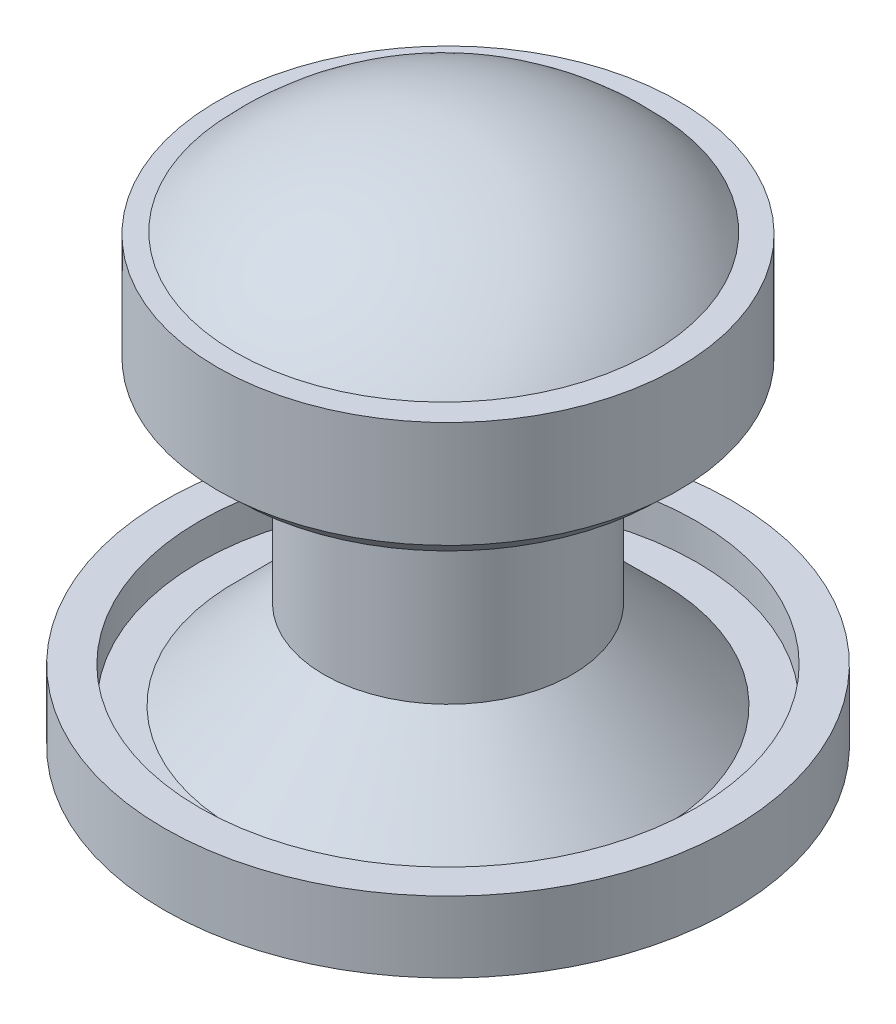
ISO-10303-21;
HEADER;
FILE_DESCRIPTION(('STEP AP214'),'2;1');
FILE_NAME('part.step','',(''),(''),'','','');
FILE_SCHEMA(('AUTOMOTIVE_DESIGN { 1 0 10303 214 1 1 1 1 }'));
ENDSEC;
DATA;
#1=APPLICATION_CONTEXT('core data for automotive mechanical design processes');
#2=APPLICATION_PROTOCOL_DEFINITION('international standard','automotive_design',2000,#1);
#3=PRODUCT_CONTEXT('',#1,'mechanical');
#4=PRODUCT('Part','Part','',(#3));
#5=PRODUCT_RELATED_PRODUCT_CATEGORY('part','',(#4));
#6=PRODUCT_DEFINITION_FORMATION('','',#4);
#7=PRODUCT_DEFINITION_CONTEXT('part definition',#1,'design');
#8=PRODUCT_DEFINITION('design','',#6,#7);
#9=PRODUCT_DEFINITION_SHAPE('','',#8);
#10=(LENGTH_UNIT() NAMED_UNIT(*) SI_UNIT(.MILLI.,.METRE.));
#11=(NAMED_UNIT(*) PLANE_ANGLE_UNIT() SI_UNIT($,.RADIAN.));
#12=(NAMED_UNIT(*) SI_UNIT($,.STERADIAN.) SOLID_ANGLE_UNIT());
#13=UNCERTAINTY_MEASURE_WITH_UNIT(LENGTH_MEASURE(1.E-05),#10,'distance_accuracy_value','');
#14=(GEOMETRIC_REPRESENTATION_CONTEXT(3) GLOBAL_UNCERTAINTY_ASSIGNED_CONTEXT((#13)) GLOBAL_UNIT_ASSIGNED_CONTEXT((#10,
#11,#12)) REPRESENTATION_CONTEXT('',''));
#15=CARTESIAN_POINT('',(0.,0.,0.));
#16=DIRECTION('',(0.,0.,1.));
#17=DIRECTION('',(1.,0.,0.));
#18=AXIS2_PLACEMENT_3D('',#15,#16,#17);
#19=CARTESIAN_POINT('',(0.,1.,0.));
#20=DIRECTION('',(0.,1.,0.));
#21=DIRECTION('',(0.,0.,1.));
#22=AXIS2_PLACEMENT_3D('',#19,#20,#21);
#23=PLANE('',#22);
#24=CARTESIAN_POINT('',(0.,1.,0.));
#25=DIRECTION('',(0.,1.,0.));
#26=DIRECTION('',(0.,0.,1.));
#27=AXIS2_PLACEMENT_3D('',#24,#25,#26);
#28=CIRCLE('',#27,6.);
#29=CARTESIAN_POINT('',(0.,1.,6.));
#30=VERTEX_POINT('',#29);
#31=EDGE_CURVE('E55',#30,#30,#28,.T.);
#32=ORIENTED_EDGE('',*,*,#31,.F.);
#33=EDGE_LOOP('',(#32));
#34=FACE_BOUND('',#33,.T.);
#35=CARTESIAN_POINT('',(0.,1.,0.));
#36=DIRECTION('',(0.,1.,0.));
#37=DIRECTION('',(0.,0.,1.));
#38=AXIS2_PLACEMENT_3D('',#35,#36,#37);
#39=CIRCLE('',#38,7.);
#40=CARTESIAN_POINT('',(0.,1.,7.));
#41=VERTEX_POINT('',#40);
#42=EDGE_CURVE('E46',#41,#41,#39,.F.);
#43=ORIENTED_EDGE('',*,*,#42,.F.);
#44=EDGE_LOOP('',(#43));
#45=FACE_BOUND('',#44,.T.);
#46=ADVANCED_FACE('F34',(#34,#45),#23,.T.);
#47=CARTESIAN_POINT('',(0.,1.,0.));
#48=DIRECTION('',(0.,-1.,0.));
#49=DIRECTION('',(0.,0.,1.));
#50=AXIS2_PLACEMENT_3D('',#47,#48,#49);
#51=CONICAL_SURFACE('',#50,6.,0.78539816339745);
#52=CARTESIAN_POINT('',(0.,3.5,0.));
#53=DIRECTION('',(0.,1.,0.));
#54=DIRECTION('',(0.,0.,1.));
#55=AXIS2_PLACEMENT_3D('',#52,#53,#54);
#56=CIRCLE('',#55,3.49999999999999);
#57=CARTESIAN_POINT('',(0.,3.5,3.49999999999999));
#58=VERTEX_POINT('',#57);
#59=EDGE_CURVE('E59',#58,#58,#56,.T.);
#60=ORIENTED_EDGE('',*,*,#59,.F.);
#61=EDGE_LOOP('',(#60));
#62=FACE_BOUND('',#61,.T.);
#63=ORIENTED_EDGE('',*,*,#31,.T.);
#64=EDGE_LOOP('',(#63));
#65=FACE_BOUND('',#64,.T.);
#66=ADVANCED_FACE('F119',(#62,#65),#51,.T.);
#67=CARTESIAN_POINT('',(0.,7.5,0.));
#68=DIRECTION('',(0.,-1.,0.));
#69=DIRECTION('',(0.,0.,-1.));
#70=AXIS2_PLACEMENT_3D('',#67,#68,#69);
#71=CYLINDRICAL_SURFACE('',#70,3.49999999999999);
#72=CARTESIAN_POINT('',(0.,7.5,0.));
#73=DIRECTION('',(0.,1.,0.));
#74=DIRECTION('',(0.,0.,1.));
#75=AXIS2_PLACEMENT_3D('',#72,#73,#74);
#76=CIRCLE('',#75,3.49999999999999);
#77=CARTESIAN_POINT('',(0.,7.5,3.49999999999999));
#78=VERTEX_POINT('',#77);
#79=EDGE_CURVE('E62',#78,#78,#76,.T.);
#80=ORIENTED_EDGE('',*,*,#79,.F.);
#81=EDGE_LOOP('',(#80));
#82=FACE_BOUND('',#81,.T.);
#83=ORIENTED_EDGE('',*,*,#59,.T.);
#84=EDGE_LOOP('',(#83));
#85=FACE_BOUND('',#84,.T.);
#86=ADVANCED_FACE('F125',(#82,#85),#71,.T.);
#87=CARTESIAN_POINT('',(0.,7.5,0.));
#88=DIRECTION('',(0.,1.,0.));
#89=DIRECTION('',(0.,0.,1.));
#90=AXIS2_PLACEMENT_3D('',#87,#88,#89);
#91=CONICAL_SURFACE('',#90,3.49999999999999,1.02974425867666);
#92=CARTESIAN_POINT('',(0.,8.95161714003039,0.));
#93=DIRECTION('',(0.,1.,0.));
#94=DIRECTION('',(0.,0.,1.));
#95=AXIS2_PLACEMENT_3D('',#92,#93,#94);
#96=CIRCLE('',#95,5.91589662238093);
#97=CARTESIAN_POINT('',(0.,8.95161714003039,5.91589662238093));
#98=VERTEX_POINT('',#97);
#99=EDGE_CURVE('E10',#98,#98,#96,.F.);
#100=ORIENTED_EDGE('',*,*,#99,.T.);
#101=EDGE_LOOP('',(#100));
#102=FACE_BOUND('',#101,.T.);
#103=ORIENTED_EDGE('',*,*,#79,.T.);
#104=EDGE_LOOP('',(#103));
#105=FACE_BOUND('',#104,.T.);
#106=ADVANCED_FACE('F132',(#102,#105),#91,.T.);
#107=CARTESIAN_POINT('',(0.,12.5,0.));
#108=DIRECTION('',(0.,-1.,0.));
#109=DIRECTION('',(0.,0.,-1.));
#110=AXIS2_PLACEMENT_3D('',#107,#108,#109);
#111=CYLINDRICAL_SURFACE('',#110,6.5);
#112=CARTESIAN_POINT('',(0.,12.5,0.));
#113=DIRECTION('',(0.,1.,0.));
#114=DIRECTION('',(0.,0.,1.));
#115=AXIS2_PLACEMENT_3D('',#112,#113,#114);
#116=CIRCLE('',#115,6.5);
#117=CARTESIAN_POINT('',(0.,12.5,6.5));
#118=VERTEX_POINT('',#117);
#119=EDGE_CURVE('E67',#118,#118,#116,.T.);
#120=ORIENTED_EDGE('',*,*,#119,.F.);
#121=EDGE_LOOP('',(#120));
#122=FACE_BOUND('',#121,.T.);
#123=CARTESIAN_POINT('',(0.,9.5,0.));
#124=DIRECTION('',(0.,1.,0.));
#125=DIRECTION('',(0.,0.,1.));
#126=AXIS2_PLACEMENT_3D('',#123,#124,#125);
#127=CIRCLE('',#126,6.5);
#128=CARTESIAN_POINT('',(0.,9.5,6.5));
#129=VERTEX_POINT('',#128);
#130=EDGE_CURVE('E68',#129,#129,#127,.T.);
#131=ORIENTED_EDGE('',*,*,#130,.T.);
#132=EDGE_LOOP('',(#131));
#133=FACE_BOUND('',#132,.T.);
#134=ADVANCED_FACE('F136',(#122,#133),#111,.T.);
#135=CARTESIAN_POINT('',(0.,12.5,0.));
#136=DIRECTION('',(0.,1.,0.));
#137=DIRECTION('',(0.,0.,1.));
#138=AXIS2_PLACEMENT_3D('',#135,#136,#137);
#139=PLANE('',#138);
#140=CARTESIAN_POINT('',(-0.12,12.5,0.));
#141=DIRECTION('',(0.,1.,0.));
#142=DIRECTION('',(0.,0.,1.));
#143=AXIS2_PLACEMENT_3D('',#140,#141,#142);
#144=CIRCLE('',#143,5.88);
#145=CARTESIAN_POINT('',(-0.12,12.5,5.88));
#146=VERTEX_POINT('',#145);
#147=EDGE_CURVE('E50',#146,#146,#144,.T.);
#148=ORIENTED_EDGE('',*,*,#147,.F.);
#149=EDGE_LOOP('',(#148));
#150=FACE_BOUND('',#149,.T.);
#151=ORIENTED_EDGE('',*,*,#119,.T.);
#152=EDGE_LOOP('',(#151));
#153=FACE_BOUND('',#152,.T.);
#154=ADVANCED_FACE('F139',(#150,#153),#139,.T.);
#155=CARTESIAN_POINT('',(0.,9.5,0.));
#156=DIRECTION('',(0.,1.,0.));
#157=DIRECTION('',(0.,0.,1.));
#158=AXIS2_PLACEMENT_3D('',#155,#156,#157);
#159=PLANE('',#158);
#160=CARTESIAN_POINT('',(0.,9.5,0.));
#161=DIRECTION('',(0.,1.,0.));
#162=DIRECTION('',(0.,0.,1.));
#163=AXIS2_PLACEMENT_3D('',#160,#161,#162);
#164=CIRCLE('',#163,6.46427948235054);
#165=CARTESIAN_POINT('',(0.,9.5,6.46427948235054));
#166=VERTEX_POINT('',#165);
#167=EDGE_CURVE('E42',#166,#166,#164,.T.);
#168=ORIENTED_EDGE('',*,*,#167,.T.);
#169=EDGE_LOOP('',(#168));
#170=FACE_BOUND('',#169,.T.);
#171=ORIENTED_EDGE('',*,*,#130,.F.);
#172=EDGE_LOOP('',(#171));
#173=FACE_BOUND('',#172,.T.);
#174=ADVANCED_FACE('F141',(#170,#173),#159,.F.);
#175=CARTESIAN_POINT('',(-0.12,7.07546315341116,0.));
#176=DIRECTION('',(0.,-1.,0.));
#177=DIRECTION('',(-1.,0.,0.));
#178=AXIS2_PLACEMENT_3D('',#175,#176,#177);
#179=SPHERICAL_SURFACE('',#178,8.);
#180=ORIENTED_EDGE('',*,*,#147,.T.);
#181=EDGE_LOOP('',(#180));
#182=FACE_BOUND('',#181,.T.);
#183=ADVANCED_FACE('F109',(#182),#179,.T.);
#184=CARTESIAN_POINT('',(0.,2.,0.));
#185=DIRECTION('',(0.,1.,0.));
#186=DIRECTION('',(0.,0.,1.));
#187=AXIS2_PLACEMENT_3D('',#184,#185,#186);
#188=PLANE('',#187);
#189=CARTESIAN_POINT('',(0.,2.,0.));
#190=DIRECTION('',(0.,1.,0.));
#191=DIRECTION('',(0.,0.,1.));
#192=AXIS2_PLACEMENT_3D('',#189,#190,#191);
#193=CIRCLE('',#192,8.);
#194=CARTESIAN_POINT('',(0.,2.,8.));
#195=VERTEX_POINT('',#194);
#196=EDGE_CURVE('E71',#195,#195,#193,.T.);
#197=ORIENTED_EDGE('',*,*,#196,.T.);
#198=EDGE_LOOP('',(#197));
#199=FACE_BOUND('',#198,.T.);
#200=CARTESIAN_POINT('',(0.,2.,0.));
#201=DIRECTION('',(0.,1.,0.));
#202=DIRECTION('',(0.,0.,1.));
#203=AXIS2_PLACEMENT_3D('',#200,#201,#202);
#204=CIRCLE('',#203,7.);
#205=CARTESIAN_POINT('',(0.,2.,7.));
#206=VERTEX_POINT('',#205);
#207=EDGE_CURVE('E76',#206,#206,#204,.T.);
#208=ORIENTED_EDGE('',*,*,#207,.F.);
#209=EDGE_LOOP('',(#208));
#210=FACE_BOUND('',#209,.T.);
#211=ADVANCED_FACE('F106',(#199,#210),#188,.T.);
#212=CARTESIAN_POINT('',(0.,2.,0.));
#213=DIRECTION('',(0.,-1.,0.));
#214=DIRECTION('',(0.,0.,-1.));
#215=AXIS2_PLACEMENT_3D('',#212,#213,#214);
#216=CYLINDRICAL_SURFACE('',#215,7.);
#217=ORIENTED_EDGE('',*,*,#207,.T.);
#218=EDGE_LOOP('',(#217));
#219=FACE_BOUND('',#218,.T.);
#220=ORIENTED_EDGE('',*,*,#42,.T.);
#221=EDGE_LOOP('',(#220));
#222=FACE_BOUND('',#221,.T.);
#223=ADVANCED_FACE('F98',(#219,#222),#216,.F.);
#224=CARTESIAN_POINT('',(0.,0.,0.));
#225=DIRECTION('',(0.,1.,0.));
#226=DIRECTION('',(0.,0.,1.));
#227=AXIS2_PLACEMENT_3D('',#224,#225,#226);
#228=PLANE('',#227);
#229=CARTESIAN_POINT('',(0.,0.,0.));
#230=DIRECTION('',(0.,-1.,0.));
#231=DIRECTION('',(0.,0.,-1.));
#232=AXIS2_PLACEMENT_3D('',#229,#230,#231);
#233=CIRCLE('',#232,1.4);
#234=CARTESIAN_POINT('',(0.,0.,-1.4));
#235=VERTEX_POINT('',#234);
#236=EDGE_CURVE('E80',#235,#235,#233,.T.);
#237=ORIENTED_EDGE('',*,*,#236,.F.);
#238=EDGE_LOOP('',(#237));
#239=FACE_BOUND('',#238,.T.);
#240=CARTESIAN_POINT('',(0.,0.,0.));
#241=DIRECTION('',(0.,1.,0.));
#242=DIRECTION('',(0.,0.,1.));
#243=AXIS2_PLACEMENT_3D('',#240,#241,#242);
#244=CIRCLE('',#243,8.);
#245=CARTESIAN_POINT('',(0.,0.,8.));
#246=VERTEX_POINT('',#245);
#247=EDGE_CURVE('E56',#246,#246,#244,.T.);
#248=ORIENTED_EDGE('',*,*,#247,.F.);
#249=EDGE_LOOP('',(#248));
#250=FACE_BOUND('',#249,.T.);
#251=ADVANCED_FACE('F95',(#239,#250),#228,.F.);
#252=CARTESIAN_POINT('',(0.,1.,0.));
#253=DIRECTION('',(0.,-1.,0.));
#254=DIRECTION('',(0.,0.,-1.));
#255=AXIS2_PLACEMENT_3D('',#252,#253,#254);
#256=CYLINDRICAL_SURFACE('',#255,8.);
#257=ORIENTED_EDGE('',*,*,#247,.T.);
#258=EDGE_LOOP('',(#257));
#259=FACE_BOUND('',#258,.T.);
#260=ORIENTED_EDGE('',*,*,#196,.F.);
#261=EDGE_LOOP('',(#260));
#262=FACE_BOUND('',#261,.T.);
#263=ADVANCED_FACE('F91',(#259,#262),#256,.T.);
#264=CARTESIAN_POINT('',(0.,6.,0.));
#265=DIRECTION('',(0.,-1.,0.));
#266=DIRECTION('',(0.,0.,-1.));
#267=AXIS2_PLACEMENT_3D('',#264,#265,#266);
#268=CYLINDRICAL_SURFACE('',#267,1.4);
#269=CARTESIAN_POINT('',(0.,6.,0.));
#270=DIRECTION('',(0.,-1.,0.));
#271=DIRECTION('',(0.,0.,-1.));
#272=AXIS2_PLACEMENT_3D('',#269,#270,#271);
#273=CIRCLE('',#272,1.4);
#274=CARTESIAN_POINT('',(0.,6.,-1.4));
#275=VERTEX_POINT('',#274);
#276=EDGE_CURVE('E79',#275,#275,#273,.T.);
#277=ORIENTED_EDGE('',*,*,#276,.F.);
#278=EDGE_LOOP('',(#277));
#279=FACE_BOUND('',#278,.T.);
#280=ORIENTED_EDGE('',*,*,#236,.T.);
#281=EDGE_LOOP('',(#280));
#282=FACE_BOUND('',#281,.T.);
#283=ADVANCED_FACE('F88',(#279,#282),#268,.F.);
#284=CARTESIAN_POINT('',(0.,6.,0.));
#285=DIRECTION('',(0.,-1.,0.));
#286=DIRECTION('',(0.,0.,-1.));
#287=AXIS2_PLACEMENT_3D('',#284,#285,#286);
#288=PLANE('',#287);
#289=ORIENTED_EDGE('',*,*,#276,.T.);
#290=EDGE_LOOP('',(#289));
#291=FACE_BOUND('',#290,.T.);
#292=ADVANCED_FACE('F86',(#291),#288,.T.);
#293=CARTESIAN_POINT('',(0.,9.5,0.));
#294=DIRECTION('',(0.,1.,0.));
#295=DIRECTION('',(0.,0.,1.));
#296=AXIS2_PLACEMENT_3D('',#293,#294,#295);
#297=CONICAL_SURFACE('',#296,6.46427948235054,0.785398163397453);
#298=ORIENTED_EDGE('',*,*,#99,.F.);
#299=EDGE_LOOP('',(#298));
#300=FACE_BOUND('',#299,.T.);
#301=ORIENTED_EDGE('',*,*,#167,.F.);
#302=EDGE_LOOP('',(#301));
#303=FACE_BOUND('',#302,.T.);
#304=ADVANCED_FACE('F37',(#300,#303),#297,.T.);
#305=CLOSED_SHELL('',(#46,#66,#86,#106,#134,#154,#174,#183,#211,#223,#251,#263,#283,#292,#304));
#306=MANIFOLD_SOLID_BREP('B2',#305);
#307=ADVANCED_BREP_SHAPE_REPRESENTATION('',(#18,#306),#14);
#308=SHAPE_DEFINITION_REPRESENTATION(#9,#307);
ENDSEC;
END-ISO-10303-21;
